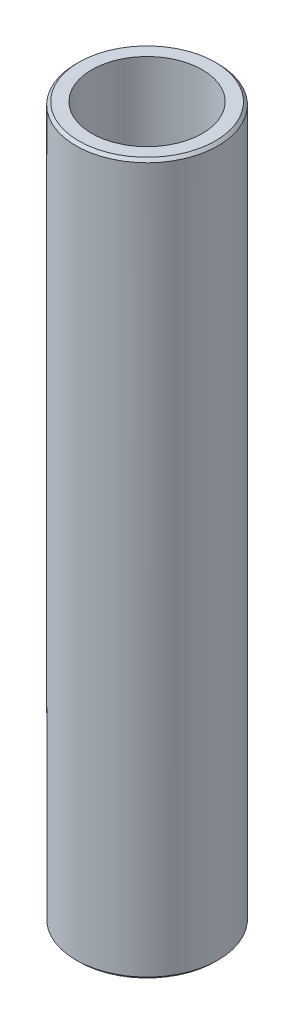
ISO-10303-21;
HEADER;
FILE_DESCRIPTION(('STEP AP214'),'2;1');
FILE_NAME('part.step','',(''),(''),'','','');
FILE_SCHEMA(('AUTOMOTIVE_DESIGN { 1 0 10303 214 1 1 1 1 }'));
ENDSEC;
DATA;
#1=APPLICATION_CONTEXT('core data for automotive mechanical design processes');
#2=APPLICATION_PROTOCOL_DEFINITION('international standard','automotive_design',2000,#1);
#3=PRODUCT_CONTEXT('',#1,'mechanical');
#4=PRODUCT('Part','Part','',(#3));
#5=PRODUCT_RELATED_PRODUCT_CATEGORY('part','',(#4));
#6=PRODUCT_DEFINITION_FORMATION('','',#4);
#7=PRODUCT_DEFINITION_CONTEXT('part definition',#1,'design');
#8=PRODUCT_DEFINITION('design','',#6,#7);
#9=PRODUCT_DEFINITION_SHAPE('','',#8);
#10=(LENGTH_UNIT() NAMED_UNIT(*) SI_UNIT(.MILLI.,.METRE.));
#11=(NAMED_UNIT(*) PLANE_ANGLE_UNIT() SI_UNIT($,.RADIAN.));
#12=(NAMED_UNIT(*) SI_UNIT($,.STERADIAN.) SOLID_ANGLE_UNIT());
#13=UNCERTAINTY_MEASURE_WITH_UNIT(LENGTH_MEASURE(1.E-05),#10,'distance_accuracy_value','');
#14=(GEOMETRIC_REPRESENTATION_CONTEXT(3) GLOBAL_UNCERTAINTY_ASSIGNED_CONTEXT((#13)) GLOBAL_UNIT_ASSIGNED_CONTEXT((#10,
#11,#12)) REPRESENTATION_CONTEXT('',''));
#15=CARTESIAN_POINT('',(0.,0.,0.));
#16=DIRECTION('',(0.,0.,1.));
#17=DIRECTION('',(1.,0.,0.));
#18=AXIS2_PLACEMENT_3D('',#15,#16,#17);
#19=CARTESIAN_POINT('',(0.,375.319432726645,0.));
#20=DIRECTION('',(0.,-1.,0.));
#21=DIRECTION('',(0.,0.,-1.));
#22=AXIS2_PLACEMENT_3D('',#19,#20,#21);
#23=CYLINDRICAL_SURFACE('',#22,37.5);
#24=CARTESIAN_POINT('',(0.,373.839588728492,0.));
#25=DIRECTION('',(0.,1.,0.));
#26=DIRECTION('',(0.,0.,1.));
#27=AXIS2_PLACEMENT_3D('',#24,#25,#26);
#28=CIRCLE('',#27,37.5);
#29=CARTESIAN_POINT('',(0.,373.839588728492,-37.5));
#30=VERTEX_POINT('',#29);
#31=EDGE_CURVE('E50',#30,#30,#28,.F.);
#32=CARTESIAN_POINT('',(0.,1.47984399815282,0.));
#33=DIRECTION('',(0.,1.,0.));
#34=DIRECTION('',(0.,0.,1.));
#35=AXIS2_PLACEMENT_3D('',#32,#33,#34);
#36=CIRCLE('',#35,37.5);
#37=CARTESIAN_POINT('',(0.,1.47984399815276,-37.5));
#38=VERTEX_POINT('',#37);
#39=EDGE_CURVE('E51',#38,#38,#36,.T.);
#40=CARTESIAN_POINT('',(0.,373.839588728492,-37.5));
#41=CARTESIAN_POINT('',(0.,369.960841387551,-37.5));
#42=CARTESIAN_POINT('',(0.,366.08209404661,-37.5));
#43=CARTESIAN_POINT('',(0.,358.324599364728,-37.5));
#44=CARTESIAN_POINT('',(0.,354.445852023787,-37.5));
#45=CARTESIAN_POINT('',(0.,346.688357341905,-37.5));
#46=CARTESIAN_POINT('',(0.,342.809610000964,-37.5));
#47=CARTESIAN_POINT('',(0.,335.052115319082,-37.5));
#48=CARTESIAN_POINT('',(0.,331.173367978141,-37.5));
#49=CARTESIAN_POINT('',(0.,323.415873296259,-37.5));
#50=CARTESIAN_POINT('',(0.,319.537125955318,-37.5));
#51=CARTESIAN_POINT('',(0.,311.779631273436,-37.5));
#52=CARTESIAN_POINT('',(0.,307.900883932495,-37.5));
#53=CARTESIAN_POINT('',(0.,300.143389250613,-37.5));
#54=CARTESIAN_POINT('',(0.,296.264641909671,-37.5));
#55=CARTESIAN_POINT('',(0.,288.507147227789,-37.5));
#56=CARTESIAN_POINT('',(0.,284.628399886848,-37.5));
#57=CARTESIAN_POINT('',(0.,276.870905204966,-37.5));
#58=CARTESIAN_POINT('',(0.,272.992157864025,-37.5));
#59=CARTESIAN_POINT('',(0.,265.234663182143,-37.5));
#60=CARTESIAN_POINT('',(0.,261.355915841202,-37.5));
#61=CARTESIAN_POINT('',(0.,253.59842115932,-37.5));
#62=CARTESIAN_POINT('',(0.,249.719673818379,-37.5));
#63=CARTESIAN_POINT('',(0.,241.962179136497,-37.5));
#64=CARTESIAN_POINT('',(0.,238.083431795556,-37.5));
#65=CARTESIAN_POINT('',(0.,230.325937113674,-37.5));
#66=CARTESIAN_POINT('',(0.,226.447189772733,-37.5));
#67=CARTESIAN_POINT('',(0.,218.689695090851,-37.5));
#68=CARTESIAN_POINT('',(0.,214.81094774991,-37.5));
#69=CARTESIAN_POINT('',(0.,207.053453068028,-37.5));
#70=CARTESIAN_POINT('',(0.,203.174705727087,-37.5));
#71=CARTESIAN_POINT('',(0.,195.417211045205,-37.5));
#72=CARTESIAN_POINT('',(0.,191.538463704264,-37.5));
#73=CARTESIAN_POINT('',(0.,183.780969022381,-37.5));
#74=CARTESIAN_POINT('',(0.,179.90222168144,-37.5));
#75=CARTESIAN_POINT('',(0.,172.144726999558,-37.5));
#76=CARTESIAN_POINT('',(0.,168.265979658617,-37.5));
#77=CARTESIAN_POINT('',(0.,160.508484976735,-37.5));
#78=CARTESIAN_POINT('',(0.,156.629737635794,-37.5));
#79=CARTESIAN_POINT('',(0.,148.872242953912,-37.5));
#80=CARTESIAN_POINT('',(0.,144.993495612971,-37.5));
#81=CARTESIAN_POINT('',(0.,137.236000931089,-37.5));
#82=CARTESIAN_POINT('',(0.,133.357253590148,-37.5));
#83=CARTESIAN_POINT('',(0.,125.599758908266,-37.5));
#84=CARTESIAN_POINT('',(0.,121.721011567325,-37.5));
#85=CARTESIAN_POINT('',(0.,113.963516885443,-37.5));
#86=CARTESIAN_POINT('',(0.,110.084769544502,-37.5));
#87=CARTESIAN_POINT('',(0.,102.32727486262,-37.5));
#88=CARTESIAN_POINT('',(0.,98.4485275216787,-37.5));
#89=CARTESIAN_POINT('',(0.,90.6910328397966,-37.5));
#90=CARTESIAN_POINT('',(0.,86.8122854988556,-37.5));
#91=CARTESIAN_POINT('',(0.,79.0547908169735,-37.5));
#92=CARTESIAN_POINT('',(0.,75.1760434760325,-37.5));
#93=CARTESIAN_POINT('',(0.,67.4185487941504,-37.5));
#94=CARTESIAN_POINT('',(0.,63.5398014532094,-37.5));
#95=CARTESIAN_POINT('',(0.,55.7823067713273,-37.5));
#96=CARTESIAN_POINT('',(0.,51.9035594303863,-37.5));
#97=CARTESIAN_POINT('',(0.,44.1460647485042,-37.5));
#98=CARTESIAN_POINT('',(0.,40.2673174075632,-37.5));
#99=CARTESIAN_POINT('',(0.,32.5098227256811,-37.5));
#100=CARTESIAN_POINT('',(0.,28.63107538474,-37.5));
#101=CARTESIAN_POINT('',(0.,20.8735807028579,-37.5));
#102=CARTESIAN_POINT('',(0.,16.9948333619169,-37.5));
#103=CARTESIAN_POINT('',(0.,9.23733868003483,-37.5));
#104=CARTESIAN_POINT('',(0.,5.35859133909379,-37.5));
#105=CARTESIAN_POINT('',(0.,1.47984399815276,-37.5));
#106=B_SPLINE_CURVE_WITH_KNOTS('',3,(#40,#41,#42,#43,#44,#45,#46,#47,#48,#49,#50,#51,#52,#53,
#54,#55,#56,#57,#58,#59,#60,#61,#62,#63,#64,#65,#66,#67,#68,#69,#70,#71,#72,#73,#74,#75,#76,#77,
#78,#79,#80,#81,#82,#83,#84,#85,#86,#87,#88,#89,#90,#91,#92,#93,#94,#95,#96,#97,#98,#99,#100,
#101,#102,#103,#104,#105),.UNSPECIFIED.,.F.,.F.,(4,2,2,2,2,2,2,2,2,2,2,2,2,2,2,2,2,2,2,2,2,2,2,
2,2,2,2,2,2,2,2,2,4),(0.,11.6362420228232,23.2724840456462,34.9087260684693,46.5449680912924,
58.1812101141155,69.8174521369386,81.4536941597617,93.0899361825849,104.726178205408,
116.362420228231,127.998662251054,139.634904273877,151.2711462967,162.907388319523,
174.543630342347,186.17987236517,197.816114387993,209.452356410816,221.088598433639,
232.724840456462,244.361082479285,255.997324502108,267.633566524931,279.269808547755,
290.906050570578,302.542292593401,314.178534616224,325.814776639047,337.45101866187,
349.087260684693,360.723502707516,372.359744730339),.UNSPECIFIED.);
#107=EDGE_CURVE('BSEAM39',#30,#38,#106,.T.);
#108=ORIENTED_EDGE('',*,*,#31,.T.);
#109=ORIENTED_EDGE('',*,*,#39,.T.);
#110=ORIENTED_EDGE('',*,*,#107,.T.);
#111=ORIENTED_EDGE('',*,*,#107,.F.);
#112=EDGE_LOOP('',(#108,#110,#109,#111));
#113=FACE_BOUND('',#112,.T.);
#114=ADVANCED_FACE('F39',(#113),#23,.T.);
#115=CARTESIAN_POINT('',(0.,375.319432726645,0.));
#116=DIRECTION('',(0.,1.,0.));
#117=DIRECTION('',(0.,0.,1.));
#118=AXIS2_PLACEMENT_3D('',#115,#116,#117);
#119=PLANE('',#118);
#120=CARTESIAN_POINT('',(0.,375.319432726645,0.));
#121=DIRECTION('',(0.,1.,0.));
#122=DIRECTION('',(0.,0.,1.));
#123=AXIS2_PLACEMENT_3D('',#120,#121,#122);
#124=CIRCLE('',#123,36.0201560018476);
#125=CARTESIAN_POINT('',(0.,375.319432726645,36.0201560018476));
#126=VERTEX_POINT('',#125);
#127=EDGE_CURVE('E54',#126,#126,#124,.T.);
#128=ORIENTED_EDGE('',*,*,#127,.T.);
#129=EDGE_LOOP('',(#128));
#130=FACE_BOUND('',#129,.T.);
#131=CARTESIAN_POINT('',(0.,375.319432726645,0.));
#132=DIRECTION('',(0.,1.,0.));
#133=DIRECTION('',(0.,0.,1.));
#134=AXIS2_PLACEMENT_3D('',#131,#132,#133);
#135=CIRCLE('',#134,29.1785782527853);
#136=CARTESIAN_POINT('',(0.,375.319432726645,-29.1785782527853));
#137=VERTEX_POINT('',#136);
#138=EDGE_CURVE('E58',#137,#137,#135,.T.);
#139=ORIENTED_EDGE('',*,*,#138,.F.);
#140=EDGE_LOOP('',(#139));
#141=FACE_BOUND('',#140,.T.);
#142=ADVANCED_FACE('F69',(#130,#141),#119,.T.);
#143=CARTESIAN_POINT('',(0.,0.,0.));
#144=DIRECTION('',(0.,1.,0.));
#145=DIRECTION('',(0.,0.,1.));
#146=AXIS2_PLACEMENT_3D('',#143,#144,#145);
#147=PLANE('',#146);
#148=CARTESIAN_POINT('',(0.,0.,0.));
#149=DIRECTION('',(0.,1.,0.));
#150=DIRECTION('',(0.,0.,1.));
#151=AXIS2_PLACEMENT_3D('',#148,#149,#150);
#152=CIRCLE('',#151,36.0201560018472);
#153=CARTESIAN_POINT('',(0.,0.,36.0201560018472));
#154=VERTEX_POINT('',#153);
#155=EDGE_CURVE('E10',#154,#154,#152,.F.);
#156=ORIENTED_EDGE('',*,*,#155,.T.);
#157=EDGE_LOOP('',(#156));
#158=FACE_BOUND('',#157,.T.);
#159=CARTESIAN_POINT('',(0.,0.,0.));
#160=DIRECTION('',(0.,1.,0.));
#161=DIRECTION('',(0.,0.,1.));
#162=AXIS2_PLACEMENT_3D('',#159,#160,#161);
#163=CIRCLE('',#162,29.1785782527853);
#164=CARTESIAN_POINT('',(0.,0.,-29.1785782527853));
#165=VERTEX_POINT('',#164);
#166=EDGE_CURVE('E63',#165,#165,#163,.T.);
#167=ORIENTED_EDGE('',*,*,#166,.T.);
#168=EDGE_LOOP('',(#167));
#169=FACE_BOUND('',#168,.T.);
#170=ADVANCED_FACE('F75',(#158,#169),#147,.F.);
#171=CARTESIAN_POINT('',(0.,375.319432726645,0.));
#172=DIRECTION('',(0.,-1.,0.));
#173=DIRECTION('',(0.,0.,-1.));
#174=AXIS2_PLACEMENT_3D('',#171,#172,#173);
#175=CYLINDRICAL_SURFACE('',#174,29.1785782527853);
#176=CARTESIAN_POINT('',(0.,375.319432726645,-29.1785782527853));
#177=CARTESIAN_POINT('',(0.,371.409855302409,-29.1785782527853));
#178=CARTESIAN_POINT('',(0.,367.500277878173,-29.1785782527853));
#179=CARTESIAN_POINT('',(0.,359.681123029701,-29.1785782527853));
#180=CARTESIAN_POINT('',(0.,355.771545605465,-29.1785782527853));
#181=CARTESIAN_POINT('',(0.,347.952390756993,-29.1785782527853));
#182=CARTESIAN_POINT('',(0.,344.042813332757,-29.1785782527853));
#183=CARTESIAN_POINT('',(0.,336.223658484286,-29.1785782527853));
#184=CARTESIAN_POINT('',(0.,332.31408106005,-29.1785782527853));
#185=CARTESIAN_POINT('',(0.,324.494926211578,-29.1785782527853));
#186=CARTESIAN_POINT('',(0.,320.585348787342,-29.1785782527853));
#187=CARTESIAN_POINT('',(0.,312.76619393887,-29.1785782527853));
#188=CARTESIAN_POINT('',(0.,308.856616514635,-29.1785782527853));
#189=CARTESIAN_POINT('',(0.,301.037461666163,-29.1785782527853));
#190=CARTESIAN_POINT('',(0.,297.127884241927,-29.1785782527853));
#191=CARTESIAN_POINT('',(0.,289.308729393455,-29.1785782527853));
#192=CARTESIAN_POINT('',(0.,285.399151969219,-29.1785782527853));
#193=CARTESIAN_POINT('',(0.,277.579997120748,-29.1785782527853));
#194=CARTESIAN_POINT('',(0.,273.670419696512,-29.1785782527853));
#195=CARTESIAN_POINT('',(0.,265.85126484804,-29.1785782527853));
#196=CARTESIAN_POINT('',(0.,261.941687423804,-29.1785782527853));
#197=CARTESIAN_POINT('',(0.,254.122532575332,-29.1785782527853));
#198=CARTESIAN_POINT('',(0.,250.212955151096,-29.1785782527853));
#199=CARTESIAN_POINT('',(0.,242.393800302625,-29.1785782527853));
#200=CARTESIAN_POINT('',(0.,238.484222878389,-29.1785782527853));
#201=CARTESIAN_POINT('',(0.,230.665068029917,-29.1785782527853));
#202=CARTESIAN_POINT('',(0.,226.755490605681,-29.1785782527853));
#203=CARTESIAN_POINT('',(0.,218.936335757209,-29.1785782527853));
#204=CARTESIAN_POINT('',(0.,215.026758332973,-29.1785782527853));
#205=CARTESIAN_POINT('',(0.,207.207603484502,-29.1785782527853));
#206=CARTESIAN_POINT('',(0.,203.298026060266,-29.1785782527853));
#207=CARTESIAN_POINT('',(0.,195.478871211794,-29.1785782527853));
#208=CARTESIAN_POINT('',(0.,191.569293787558,-29.1785782527853));
#209=CARTESIAN_POINT('',(0.,183.750138939086,-29.1785782527853));
#210=CARTESIAN_POINT('',(0.,179.84056151485,-29.1785782527853));
#211=CARTESIAN_POINT('',(0.,172.021406666379,-29.1785782527853));
#212=CARTESIAN_POINT('',(0.,168.111829242143,-29.1785782527853));
#213=CARTESIAN_POINT('',(0.,160.292674393671,-29.1785782527853));
#214=CARTESIAN_POINT('',(0.,156.383096969435,-29.1785782527853));
#215=CARTESIAN_POINT('',(0.,148.563942120963,-29.1785782527853));
#216=CARTESIAN_POINT('',(0.,144.654364696728,-29.1785782527853));
#217=CARTESIAN_POINT('',(0.,136.835209848256,-29.1785782527853));
#218=CARTESIAN_POINT('',(0.,132.92563242402,-29.1785782527853));
#219=CARTESIAN_POINT('',(0.,125.106477575548,-29.1785782527853));
#220=CARTESIAN_POINT('',(0.,121.196900151312,-29.1785782527853));
#221=CARTESIAN_POINT('',(0.,113.377745302841,-29.1785782527853));
#222=CARTESIAN_POINT('',(0.,109.468167878605,-29.1785782527853));
#223=CARTESIAN_POINT('',(0.,101.649013030133,-29.1785782527853));
#224=CARTESIAN_POINT('',(0.,97.739435605897,-29.1785782527853));
#225=CARTESIAN_POINT('',(0.,89.9202807574252,-29.1785782527853));
#226=CARTESIAN_POINT('',(0.,86.0107033331893,-29.1785782527853));
#227=CARTESIAN_POINT('',(0.,78.1915484847176,-29.1785782527853));
#228=CARTESIAN_POINT('',(0.,74.2819710604817,-29.1785782527853));
#229=CARTESIAN_POINT('',(0.,66.4628162120099,-29.1785782527853));
#230=CARTESIAN_POINT('',(0.,62.553238787774,-29.1785782527853));
#231=CARTESIAN_POINT('',(0.,54.7340839393023,-29.1785782527853));
#232=CARTESIAN_POINT('',(0.,50.8245065150664,-29.1785782527853));
#233=CARTESIAN_POINT('',(0.,43.0053516665947,-29.1785782527853));
#234=CARTESIAN_POINT('',(0.,39.0957742423588,-29.1785782527853));
#235=CARTESIAN_POINT('',(0.,31.276619393887,-29.1785782527853));
#236=CARTESIAN_POINT('',(0.,27.3670419696511,-29.1785782527853));
#237=CARTESIAN_POINT('',(0.,19.5478871211794,-29.1785782527853));
#238=CARTESIAN_POINT('',(0.,15.6383096969435,-29.1785782527853));
#239=CARTESIAN_POINT('',(0.,7.81915484847171,-29.1785782527853));
#240=CARTESIAN_POINT('',(0.,3.90957742423583,-29.1785782527853));
#241=CARTESIAN_POINT('',(0.,0.,-29.1785782527853));
#242=B_SPLINE_CURVE_WITH_KNOTS('',3,(#176,#177,#178,#179,#180,#181,#182,#183,#184,#185,#186,
#187,#188,#189,#190,#191,#192,#193,#194,#195,#196,#197,#198,#199,#200,#201,#202,#203,#204,#205,
#206,#207,#208,#209,#210,#211,#212,#213,#214,#215,#216,#217,#218,#219,#220,#221,#222,#223,#224,
#225,#226,#227,#228,#229,#230,#231,#232,#233,#234,#235,#236,#237,#238,#239,#240,#241),
.UNSPECIFIED.,.F.,.F.,(4,2,2,2,2,2,2,2,2,2,2,2,2,2,2,2,2,2,2,2,2,2,2,2,2,2,2,2,2,2,2,2,4),(0.,
11.7287322727077,23.4574645454153,35.186196818123,46.9149290908306,58.6436613635383,
70.3723936362459,82.1011259089535,93.8298581816612,105.558590454369,117.287322727076,
129.016054999784,140.744787272492,152.473519545199,164.202251817907,175.930984090615,
187.659716363322,199.38844863603,211.117180908738,222.845913181445,234.574645454153,
246.303377726861,258.032109999568,269.760842272276,281.489574544983,293.218306817691,
304.947039090399,316.675771363106,328.404503635814,340.133235908522,351.861968181229,
363.590700453937,375.319432726645),.UNSPECIFIED.);
#243=EDGE_CURVE('BSEAM70',#137,#165,#242,.T.);
#244=ORIENTED_EDGE('',*,*,#138,.T.);
#245=ORIENTED_EDGE('',*,*,#166,.F.);
#246=ORIENTED_EDGE('',*,*,#243,.T.);
#247=ORIENTED_EDGE('',*,*,#243,.F.);
#248=EDGE_LOOP('',(#244,#246,#245,#247));
#249=FACE_BOUND('',#248,.T.);
#250=ADVANCED_FACE('F70',(#249),#175,.F.);
#251=CARTESIAN_POINT('',(0.,375.319432726645,0.));
#252=DIRECTION('',(0.,-1.,0.));
#253=DIRECTION('',(0.,0.,-1.));
#254=AXIS2_PLACEMENT_3D('',#251,#252,#253);
#255=CONICAL_SURFACE('',#254,36.0201560018476,0.785398163397441);
#256=ORIENTED_EDGE('',*,*,#31,.F.);
#257=EDGE_LOOP('',(#256));
#258=FACE_BOUND('',#257,.T.);
#259=ORIENTED_EDGE('',*,*,#127,.F.);
#260=EDGE_LOOP('',(#259));
#261=FACE_BOUND('',#260,.T.);
#262=ADVANCED_FACE('F81',(#258,#261),#255,.T.);
#263=CARTESIAN_POINT('',(0.,1.47984399815282,0.));
#264=DIRECTION('',(0.,1.,0.));
#265=DIRECTION('',(0.,0.,1.));
#266=AXIS2_PLACEMENT_3D('',#263,#264,#265);
#267=CONICAL_SURFACE('',#266,37.5,0.785398163397441);
#268=ORIENTED_EDGE('',*,*,#155,.F.);
#269=EDGE_LOOP('',(#268));
#270=FACE_BOUND('',#269,.T.);
#271=ORIENTED_EDGE('',*,*,#39,.F.);
#272=EDGE_LOOP('',(#271));
#273=FACE_BOUND('',#272,.T.);
#274=ADVANCED_FACE('F45',(#270,#273),#267,.T.);
#275=CLOSED_SHELL('',(#114,#142,#170,#250,#262,#274));
#276=MANIFOLD_SOLID_BREP('B2',#275);
#277=ADVANCED_BREP_SHAPE_REPRESENTATION('',(#18,#276),#14);
#278=SHAPE_DEFINITION_REPRESENTATION(#9,#277);
ENDSEC;
END-ISO-10303-21;
